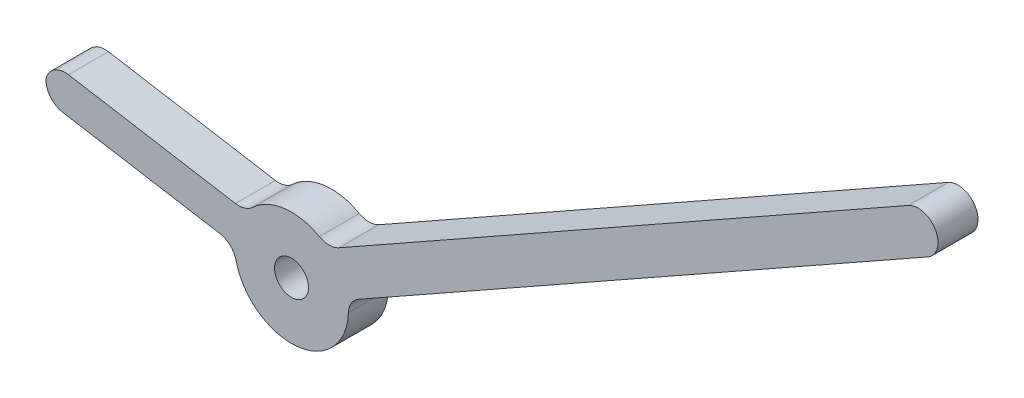
ISO-10303-21;
HEADER;
FILE_DESCRIPTION(('STEP AP214'),'2;1');
FILE_NAME('part.step','',(''),(''),'','','');
FILE_SCHEMA(('AUTOMOTIVE_DESIGN { 1 0 10303 214 1 1 1 1 }'));
ENDSEC;
DATA;
#1=APPLICATION_CONTEXT('core data for automotive mechanical design processes');
#2=APPLICATION_PROTOCOL_DEFINITION('international standard','automotive_design',2000,#1);
#3=PRODUCT_CONTEXT('',#1,'mechanical');
#4=PRODUCT('Part','Part','',(#3));
#5=PRODUCT_RELATED_PRODUCT_CATEGORY('part','',(#4));
#6=PRODUCT_DEFINITION_FORMATION('','',#4);
#7=PRODUCT_DEFINITION_CONTEXT('part definition',#1,'design');
#8=PRODUCT_DEFINITION('design','',#6,#7);
#9=PRODUCT_DEFINITION_SHAPE('','',#8);
#10=(LENGTH_UNIT() NAMED_UNIT(*) SI_UNIT(.MILLI.,.METRE.));
#11=(NAMED_UNIT(*) PLANE_ANGLE_UNIT() SI_UNIT($,.RADIAN.));
#12=(NAMED_UNIT(*) SI_UNIT($,.STERADIAN.) SOLID_ANGLE_UNIT());
#13=UNCERTAINTY_MEASURE_WITH_UNIT(LENGTH_MEASURE(1.E-05),#10,'distance_accuracy_value','');
#14=(GEOMETRIC_REPRESENTATION_CONTEXT(3) GLOBAL_UNCERTAINTY_ASSIGNED_CONTEXT((#13)) GLOBAL_UNIT_ASSIGNED_CONTEXT((#10,
#11,#12)) REPRESENTATION_CONTEXT('',''));
#15=CARTESIAN_POINT('',(0.,0.,0.));
#16=DIRECTION('',(0.,0.,1.));
#17=DIRECTION('',(1.,0.,0.));
#18=AXIS2_PLACEMENT_3D('',#15,#16,#17);
#19=CARTESIAN_POINT('',(0.,0.,5.08));
#20=DIRECTION('',(0.,0.,1.));
#21=DIRECTION('',(1.,0.,0.));
#22=AXIS2_PLACEMENT_3D('',#19,#20,#21);
#23=PLANE('',#22);
#24=CARTESIAN_POINT('',(0.,0.,5.08));
#25=DIRECTION('',(0.,0.,1.));
#26=DIRECTION('',(1.,0.,0.));
#27=AXIS2_PLACEMENT_3D('',#24,#25,#26);
#28=CIRCLE('',#27,2.159);
#29=CARTESIAN_POINT('',(2.159,0.,5.08));
#30=VERTEX_POINT('',#29);
#31=EDGE_CURVE('E214',#30,#30,#28,.T.);
#32=ORIENTED_EDGE('',*,*,#31,.F.);
#33=EDGE_LOOP('',(#32));
#34=FACE_BOUND('',#33,.T.);
#35=CARTESIAN_POINT('',(-28.7825653172988,5.67657491410361,5.08));
#36=DIRECTION('',(0.,0.,1.));
#37=DIRECTION('',(1.,0.,0.));
#38=AXIS2_PLACEMENT_3D('',#35,#36,#37);
#39=CIRCLE('',#38,2.54);
#40=CARTESIAN_POINT('',(-28.361591001819,8.18144629317806,5.08));
#41=VERTEX_POINT('',#40);
#42=CARTESIAN_POINT('',(-31.2056449020925,6.43833952719351,5.08));
#43=VERTEX_POINT('',#42);
#44=EDGE_CURVE('E217',#41,#43,#39,.T.);
#45=ORIENTED_EDGE('',*,*,#44,.T.);
#46=CARTESIAN_POINT('',(-28.6789330522204,6.17886461951211,5.08));
#47=DIRECTION('',(0.,0.,1.));
#48=DIRECTION('',(1.,0.,0.));
#49=AXIS2_PLACEMENT_3D('',#46,#47,#48);
#50=CIRCLE('',#49,2.54);
#51=CARTESIAN_POINT('',(-29.0999073677003,3.67399324043767,5.08));
#52=VERTEX_POINT('',#51);
#53=EDGE_CURVE('E236',#43,#52,#50,.T.);
#54=ORIENTED_EDGE('',*,*,#53,.T.);
#55=DIRECTION('',(-0.986169834281277,0.165737919480243,0.));
#56=VECTOR('',#55,1.);
#57=CARTESIAN_POINT('',(-0.198848510526395,-1.1831836871602,5.08));
#58=LINE('',#57,#56);
#59=CARTESIAN_POINT('',(-9.10953067593622,0.314365590770257,5.08));
#60=VERTEX_POINT('',#59);
#61=EDGE_CURVE('E223',#60,#52,#58,.T.);
#62=ORIENTED_EDGE('',*,*,#61,.F.);
#63=CARTESIAN_POINT('',(-9.53050499141603,-2.19050578830419,5.08));
#64=DIRECTION('',(0.,0.,1.));
#65=DIRECTION('',(1.,0.,0.));
#66=AXIS2_PLACEMENT_3D('',#63,#64,#65);
#67=CIRCLE('',#66,2.54);
#68=CARTESIAN_POINT('',(-7.05504914948979,-1.62154324588751,5.08));
#69=VERTEX_POINT('',#68);
#70=EDGE_CURVE('E268',#60,#69,#67,.F.);
#71=ORIENTED_EDGE('',*,*,#70,.T.);
#72=CARTESIAN_POINT('',(0.,0.,5.08));
#73=DIRECTION('',(0.,0.,1.));
#74=DIRECTION('',(1.,0.,0.));
#75=AXIS2_PLACEMENT_3D('',#72,#73,#74);
#76=CIRCLE('',#75,7.239);
#77=CARTESIAN_POINT('',(7.23520316387898,-0.234427339266629,5.08));
#78=VERTEX_POINT('',#77);
#79=EDGE_CURVE('E228',#69,#78,#76,.T.);
#80=ORIENTED_EDGE('',*,*,#79,.T.);
#81=CARTESIAN_POINT('',(9.77387094067862,-0.31668254602685,5.08));
#82=DIRECTION('',(0.,0.,1.));
#83=DIRECTION('',(1.,0.,0.));
#84=AXIS2_PLACEMENT_3D('',#81,#82,#83);
#85=CIRCLE('',#84,2.54);
#86=CARTESIAN_POINT('',(8.52536810292188,1.89529409582843,5.08));
#87=VERTEX_POINT('',#86);
#88=EDGE_CURVE('E265',#78,#87,#85,.F.);
#89=ORIENTED_EDGE('',*,*,#88,.T.);
#90=DIRECTION('',(0.870856945612317,0.491536550297927,0.));
#91=VECTOR('',#90,1.);
#92=CARTESIAN_POINT('',(1.24850283775674,-2.21197664185528,5.08));
#93=LINE('',#92,#91);
#94=CARTESIAN_POINT('',(80.9205819049126,42.7572219125618,5.08));
#95=VERTEX_POINT('',#94);
#96=EDGE_CURVE('E211',#87,#95,#93,.T.);
#97=ORIENTED_EDGE('',*,*,#96,.T.);
#98=CARTESIAN_POINT('',(79.6720790671559,44.9691985544171,5.08));
#99=DIRECTION('',(0.,0.,1.));
#100=DIRECTION('',(1.,0.,0.));
#101=AXIS2_PLACEMENT_3D('',#98,#99,#100);
#102=CIRCLE('',#101,2.54);
#103=CARTESIAN_POINT('',(78.4235762293991,47.1811751962724,5.08));
#104=VERTEX_POINT('',#103);
#105=EDGE_CURVE('E199',#95,#104,#102,.T.);
#106=ORIENTED_EDGE('',*,*,#105,.T.);
#107=DIRECTION('',(0.870856945612317,0.491536550297927,0.));
#108=VECTOR('',#107,1.);
#109=CARTESIAN_POINT('',(-1.24850283775674,2.21197664185528,5.08));
#110=LINE('',#109,#108);
#111=CARTESIAN_POINT('',(6.02836242740841,6.319247379539,5.08));
#112=VERTEX_POINT('',#111);
#113=EDGE_CURVE('E192',#112,#104,#110,.T.);
#114=ORIENTED_EDGE('',*,*,#113,.F.);
#115=CARTESIAN_POINT('',(4.77985958965168,8.53122402139429,5.08));
#116=DIRECTION('',(0.,0.,1.));
#117=DIRECTION('',(1.,0.,0.));
#118=AXIS2_PLACEMENT_3D('',#115,#116,#117);
#119=CIRCLE('',#118,2.54);
#120=CARTESIAN_POINT('',(3.53833761831358,6.31532167817499,5.08));
#121=VERTEX_POINT('',#120);
#122=EDGE_CURVE('E96',#112,#121,#119,.F.);
#123=ORIENTED_EDGE('',*,*,#122,.T.);
#124=CARTESIAN_POINT('',(0.,0.,5.08));
#125=DIRECTION('',(0.,0.,1.));
#126=DIRECTION('',(1.,0.,0.));
#127=AXIS2_PLACEMENT_3D('',#124,#125,#126);
#128=CIRCLE('',#127,7.239);
#129=CARTESIAN_POINT('',(-4.96410951537032,5.26884595707731,5.08));
#130=VERTEX_POINT('',#129);
#131=EDGE_CURVE('E222',#121,#130,#128,.T.);
#132=ORIENTED_EDGE('',*,*,#131,.T.);
#133=CARTESIAN_POINT('',(-6.70590232778095,7.11756383675356,5.08));
#134=DIRECTION('',(0.,0.,1.));
#135=DIRECTION('',(1.,0.,0.));
#136=AXIS2_PLACEMENT_3D('',#133,#134,#135);
#137=CIRCLE('',#136,2.54);
#138=CARTESIAN_POINT('',(-7.12687664326077,4.61269245767911,5.08));
#139=VERTEX_POINT('',#138);
#140=EDGE_CURVE('E272',#130,#139,#137,.F.);
#141=ORIENTED_EDGE('',*,*,#140,.T.);
#142=DIRECTION('',(-0.986169834281277,0.165737919480242,0.));
#143=VECTOR('',#142,1.);
#144=CARTESIAN_POINT('',(-5.76116023717156,4.38316708803502,5.08));
#145=LINE('',#144,#143);
#146=EDGE_CURVE('E226',#139,#41,#145,.T.);
#147=ORIENTED_EDGE('',*,*,#146,.T.);
#148=EDGE_LOOP('',(#45,#54,#62,#71,#80,#89,#97,#106,#114,#123,#132,#141,#147));
#149=FACE_BOUND('',#148,.T.);
#150=ADVANCED_FACE('F87',(#34,#149),#23,.T.);
#151=CARTESIAN_POINT('',(0.,0.,0.));
#152=DIRECTION('',(0.,0.,1.));
#153=DIRECTION('',(1.,0.,0.));
#154=AXIS2_PLACEMENT_3D('',#151,#152,#153);
#155=PLANE('',#154);
#156=CARTESIAN_POINT('',(0.,0.,0.));
#157=DIRECTION('',(0.,0.,1.));
#158=DIRECTION('',(1.,0.,0.));
#159=AXIS2_PLACEMENT_3D('',#156,#157,#158);
#160=CIRCLE('',#159,2.159);
#161=CARTESIAN_POINT('',(2.159,0.,0.));
#162=VERTEX_POINT('',#161);
#163=EDGE_CURVE('E212',#162,#162,#160,.T.);
#164=ORIENTED_EDGE('',*,*,#163,.T.);
#165=EDGE_LOOP('',(#164));
#166=FACE_BOUND('',#165,.T.);
#167=DIRECTION('',(-0.986169834281277,0.165737919480243,0.));
#168=VECTOR('',#167,1.);
#169=CARTESIAN_POINT('',(-0.198848510526395,-1.1831836871602,0.));
#170=LINE('',#169,#168);
#171=CARTESIAN_POINT('',(-9.10953067593622,0.314365590770257,0.));
#172=VERTEX_POINT('',#171);
#173=CARTESIAN_POINT('',(-29.0999073677003,3.67399324043767,0.));
#174=VERTEX_POINT('',#173);
#175=EDGE_CURVE('E227',#172,#174,#170,.T.);
#176=ORIENTED_EDGE('',*,*,#175,.T.);
#177=CARTESIAN_POINT('',(-28.6789330522204,6.17886461951211,0.));
#178=DIRECTION('',(0.,0.,1.));
#179=DIRECTION('',(1.,0.,0.));
#180=AXIS2_PLACEMENT_3D('',#177,#178,#179);
#181=CIRCLE('',#180,2.54);
#182=CARTESIAN_POINT('',(-31.2056449020925,6.43833952719351,0.));
#183=VERTEX_POINT('',#182);
#184=EDGE_CURVE('E103',#174,#183,#181,.F.);
#185=ORIENTED_EDGE('',*,*,#184,.T.);
#186=CARTESIAN_POINT('',(-28.7825653172988,5.67657491410361,0.));
#187=DIRECTION('',(0.,0.,1.));
#188=DIRECTION('',(1.,0.,0.));
#189=AXIS2_PLACEMENT_3D('',#186,#187,#188);
#190=CIRCLE('',#189,2.54);
#191=CARTESIAN_POINT('',(-28.361591001819,8.18144629317806,0.));
#192=VERTEX_POINT('',#191);
#193=EDGE_CURVE('E244',#183,#192,#190,.F.);
#194=ORIENTED_EDGE('',*,*,#193,.T.);
#195=DIRECTION('',(-0.986169834281277,0.165737919480243,0.));
#196=VECTOR('',#195,1.);
#197=CARTESIAN_POINT('',(0.558156328856895,3.32112853870757,0.));
#198=LINE('',#197,#196);
#199=CARTESIAN_POINT('',(-7.12687664326077,4.61269245767911,0.));
#200=VERTEX_POINT('',#199);
#201=EDGE_CURVE('E308',#200,#192,#198,.T.);
#202=ORIENTED_EDGE('',*,*,#201,.F.);
#203=CARTESIAN_POINT('',(-6.70590232778095,7.11756383675356,0.));
#204=DIRECTION('',(0.,0.,1.));
#205=DIRECTION('',(1.,0.,0.));
#206=AXIS2_PLACEMENT_3D('',#203,#204,#205);
#207=CIRCLE('',#206,2.54);
#208=CARTESIAN_POINT('',(-4.96410951537032,5.26884595707731,0.));
#209=VERTEX_POINT('',#208);
#210=EDGE_CURVE('E274',#200,#209,#207,.T.);
#211=ORIENTED_EDGE('',*,*,#210,.T.);
#212=CARTESIAN_POINT('',(0.,0.,0.));
#213=DIRECTION('',(0.,0.,1.));
#214=DIRECTION('',(1.,0.,0.));
#215=AXIS2_PLACEMENT_3D('',#212,#213,#214);
#216=CIRCLE('',#215,7.239);
#217=CARTESIAN_POINT('',(3.53833761831358,6.31532167817499,0.));
#218=VERTEX_POINT('',#217);
#219=EDGE_CURVE('E288',#218,#209,#216,.T.);
#220=ORIENTED_EDGE('',*,*,#219,.F.);
#221=CARTESIAN_POINT('',(4.77985958965168,8.53122402139429,0.));
#222=DIRECTION('',(0.,0.,1.));
#223=DIRECTION('',(1.,0.,0.));
#224=AXIS2_PLACEMENT_3D('',#221,#222,#223);
#225=CIRCLE('',#224,2.54);
#226=CARTESIAN_POINT('',(6.02836242740841,6.319247379539,0.));
#227=VERTEX_POINT('',#226);
#228=EDGE_CURVE('E12',#218,#227,#225,.T.);
#229=ORIENTED_EDGE('',*,*,#228,.T.);
#230=DIRECTION('',(0.870856945612317,0.491536550297927,0.));
#231=VECTOR('',#230,1.);
#232=CARTESIAN_POINT('',(-1.24850283775674,2.21197664185528,0.));
#233=LINE('',#232,#231);
#234=CARTESIAN_POINT('',(78.4235762293991,47.1811751962724,0.));
#235=VERTEX_POINT('',#234);
#236=EDGE_CURVE('E201',#227,#235,#233,.T.);
#237=ORIENTED_EDGE('',*,*,#236,.T.);
#238=CARTESIAN_POINT('',(79.6720790671559,44.9691985544171,0.));
#239=DIRECTION('',(0.,0.,1.));
#240=DIRECTION('',(1.,0.,0.));
#241=AXIS2_PLACEMENT_3D('',#238,#239,#240);
#242=CIRCLE('',#241,2.54);
#243=CARTESIAN_POINT('',(80.9205819049126,42.7572219125618,0.));
#244=VERTEX_POINT('',#243);
#245=EDGE_CURVE('E191',#244,#235,#242,.T.);
#246=ORIENTED_EDGE('',*,*,#245,.F.);
#247=DIRECTION('',(0.870856945612317,0.491536550297927,0.));
#248=VECTOR('',#247,1.);
#249=CARTESIAN_POINT('',(1.24850283775674,-2.21197664185528,0.));
#250=LINE('',#249,#248);
#251=CARTESIAN_POINT('',(8.52536810292188,1.89529409582843,0.));
#252=VERTEX_POINT('',#251);
#253=EDGE_CURVE('E182',#252,#244,#250,.T.);
#254=ORIENTED_EDGE('',*,*,#253,.F.);
#255=CARTESIAN_POINT('',(9.77387094067862,-0.31668254602685,0.));
#256=DIRECTION('',(0.,0.,1.));
#257=DIRECTION('',(1.,0.,0.));
#258=AXIS2_PLACEMENT_3D('',#255,#256,#257);
#259=CIRCLE('',#258,2.54);
#260=CARTESIAN_POINT('',(7.23520316387898,-0.234427339266629,0.));
#261=VERTEX_POINT('',#260);
#262=EDGE_CURVE('E110',#252,#261,#259,.T.);
#263=ORIENTED_EDGE('',*,*,#262,.T.);
#264=CARTESIAN_POINT('',(0.,0.,0.));
#265=DIRECTION('',(0.,0.,1.));
#266=DIRECTION('',(1.,0.,0.));
#267=AXIS2_PLACEMENT_3D('',#264,#265,#266);
#268=CIRCLE('',#267,7.239);
#269=CARTESIAN_POINT('',(-7.05504914948979,-1.62154324588751,0.));
#270=VERTEX_POINT('',#269);
#271=EDGE_CURVE('E298',#270,#261,#268,.T.);
#272=ORIENTED_EDGE('',*,*,#271,.F.);
#273=CARTESIAN_POINT('',(-9.53050499141603,-2.19050578830419,0.));
#274=DIRECTION('',(0.,0.,1.));
#275=DIRECTION('',(1.,0.,0.));
#276=AXIS2_PLACEMENT_3D('',#273,#274,#275);
#277=CIRCLE('',#276,2.54);
#278=EDGE_CURVE('E270',#270,#172,#277,.T.);
#279=ORIENTED_EDGE('',*,*,#278,.T.);
#280=EDGE_LOOP('',(#176,#185,#194,#202,#211,#220,#229,#237,#246,#254,#263,#272,#279));
#281=FACE_BOUND('',#280,.T.);
#282=ADVANCED_FACE('F203',(#166,#281),#155,.F.);
#283=CARTESIAN_POINT('',(0.,0.,5.08));
#284=DIRECTION('',(0.,0.,-1.));
#285=DIRECTION('',(-1.,0.,0.));
#286=AXIS2_PLACEMENT_3D('',#283,#284,#285);
#287=CYLINDRICAL_SURFACE('',#286,2.159);
#288=ORIENTED_EDGE('',*,*,#31,.T.);
#289=EDGE_LOOP('',(#288));
#290=FACE_BOUND('',#289,.T.);
#291=ORIENTED_EDGE('',*,*,#163,.F.);
#292=EDGE_LOOP('',(#291));
#293=FACE_BOUND('',#292,.T.);
#294=ADVANCED_FACE('F342',(#290,#293),#287,.F.);
#295=CARTESIAN_POINT('',(1.24850283775674,-2.21197664185528,0.));
#296=DIRECTION('',(0.491536550297927,-0.870856945612317,0.));
#297=DIRECTION('',(0.870856945612317,0.491536550297927,0.));
#298=AXIS2_PLACEMENT_3D('',#295,#296,#297);
#299=PLANE('',#298);
#300=ORIENTED_EDGE('',*,*,#96,.F.);
#301=DIRECTION('',(0.,0.,-1.));
#302=VECTOR('',#301,1.);
#303=CARTESIAN_POINT('',(8.52536810292188,1.89529409582843,0.));
#304=LINE('',#303,#302);
#305=EDGE_CURVE('E189',#87,#252,#304,.T.);
#306=ORIENTED_EDGE('',*,*,#305,.T.);
#307=ORIENTED_EDGE('',*,*,#253,.T.);
#308=DIRECTION('',(0.,0.,1.));
#309=VECTOR('',#308,1.);
#310=CARTESIAN_POINT('',(80.9205819049126,42.7572219125618,0.));
#311=LINE('',#310,#309);
#312=EDGE_CURVE('E186',#244,#95,#311,.T.);
#313=ORIENTED_EDGE('',*,*,#312,.T.);
#314=EDGE_LOOP('',(#300,#306,#307,#313));
#315=FACE_BOUND('',#314,.T.);
#316=ADVANCED_FACE('F185',(#315),#299,.T.);
#317=CARTESIAN_POINT('',(-1.24850283775674,2.21197664185528,0.));
#318=DIRECTION('',(0.491536550297927,-0.870856945612317,0.));
#319=DIRECTION('',(0.870856945612317,0.491536550297927,0.));
#320=AXIS2_PLACEMENT_3D('',#317,#318,#319);
#321=PLANE('',#320);
#322=ORIENTED_EDGE('',*,*,#236,.F.);
#323=DIRECTION('',(0.,0.,1.));
#324=VECTOR('',#323,1.);
#325=CARTESIAN_POINT('',(6.02836242740841,6.319247379539,0.));
#326=LINE('',#325,#324);
#327=EDGE_CURVE('E262',#227,#112,#326,.T.);
#328=ORIENTED_EDGE('',*,*,#327,.T.);
#329=ORIENTED_EDGE('',*,*,#113,.T.);
#330=DIRECTION('',(0.,0.,1.));
#331=VECTOR('',#330,1.);
#332=CARTESIAN_POINT('',(78.4235762293991,47.1811751962724,0.));
#333=LINE('',#332,#331);
#334=EDGE_CURVE('E200',#235,#104,#333,.T.);
#335=ORIENTED_EDGE('',*,*,#334,.F.);
#336=EDGE_LOOP('',(#322,#328,#329,#335));
#337=FACE_BOUND('',#336,.T.);
#338=ADVANCED_FACE('F290',(#337),#321,.F.);
#339=CARTESIAN_POINT('',(79.6720790671559,44.9691985544171,0.));
#340=DIRECTION('',(0.,0.,1.));
#341=DIRECTION('',(1.,0.,0.));
#342=AXIS2_PLACEMENT_3D('',#339,#340,#341);
#343=CYLINDRICAL_SURFACE('',#342,2.54);
#344=ORIENTED_EDGE('',*,*,#105,.F.);
#345=ORIENTED_EDGE('',*,*,#312,.F.);
#346=ORIENTED_EDGE('',*,*,#245,.T.);
#347=ORIENTED_EDGE('',*,*,#334,.T.);
#348=EDGE_LOOP('',(#344,#345,#346,#347));
#349=FACE_BOUND('',#348,.T.);
#350=ADVANCED_FACE('F196',(#349),#343,.T.);
#351=CARTESIAN_POINT('',(0.,0.,0.));
#352=DIRECTION('',(0.,0.,1.));
#353=DIRECTION('',(1.,0.,0.));
#354=AXIS2_PLACEMENT_3D('',#351,#352,#353);
#355=CYLINDRICAL_SURFACE('',#354,7.239);
#356=ORIENTED_EDGE('',*,*,#219,.T.);
#357=DIRECTION('',(0.,0.,1.));
#358=VECTOR('',#357,1.);
#359=CARTESIAN_POINT('',(-4.96410951537032,5.26884595707731,0.));
#360=LINE('',#359,#358);
#361=EDGE_CURVE('E259',#209,#130,#360,.T.);
#362=ORIENTED_EDGE('',*,*,#361,.T.);
#363=ORIENTED_EDGE('',*,*,#131,.F.);
#364=DIRECTION('',(0.,0.,1.));
#365=VECTOR('',#364,1.);
#366=CARTESIAN_POINT('',(3.53833761831358,6.31532167817499,0.));
#367=LINE('',#366,#365);
#368=EDGE_CURVE('E257',#121,#218,#367,.F.);
#369=ORIENTED_EDGE('',*,*,#368,.T.);
#370=EDGE_LOOP('',(#356,#362,#363,#369));
#371=FACE_BOUND('',#370,.T.);
#372=ADVANCED_FACE('F284',(#371),#355,.T.);
#373=CARTESIAN_POINT('',(0.558156328856895,3.32112853870757,0.));
#374=DIRECTION('',(0.165737919480243,0.986169834281277,0.));
#375=DIRECTION('',(-0.986169834281277,0.165737919480243,0.));
#376=AXIS2_PLACEMENT_3D('',#373,#374,#375);
#377=PLANE('',#376);
#378=ORIENTED_EDGE('',*,*,#201,.T.);
#379=DIRECTION('',(0.,0.,1.));
#380=VECTOR('',#379,1.);
#381=CARTESIAN_POINT('',(-28.361591001819,8.18144629317806,5.08));
#382=LINE('',#381,#380);
#383=EDGE_CURVE('E249',#192,#41,#382,.T.);
#384=ORIENTED_EDGE('',*,*,#383,.T.);
#385=ORIENTED_EDGE('',*,*,#146,.F.);
#386=DIRECTION('',(0.,0.,-1.));
#387=VECTOR('',#386,1.);
#388=CARTESIAN_POINT('',(-7.12687664326077,4.61269245767911,0.));
#389=LINE('',#388,#387);
#390=EDGE_CURVE('E247',#139,#200,#389,.T.);
#391=ORIENTED_EDGE('',*,*,#390,.T.);
#392=EDGE_LOOP('',(#378,#384,#385,#391));
#393=FACE_BOUND('',#392,.T.);
#394=ADVANCED_FACE('F325',(#393),#377,.T.);
#395=CARTESIAN_POINT('',(0.,0.,0.));
#396=DIRECTION('',(0.,0.,1.));
#397=DIRECTION('',(1.,0.,0.));
#398=AXIS2_PLACEMENT_3D('',#395,#396,#397);
#399=CYLINDRICAL_SURFACE('',#398,7.239);
#400=ORIENTED_EDGE('',*,*,#271,.T.);
#401=DIRECTION('',(0.,0.,1.));
#402=VECTOR('',#401,1.);
#403=CARTESIAN_POINT('',(7.23520316387898,-0.234427339266629,0.));
#404=LINE('',#403,#402);
#405=EDGE_CURVE('E253',#261,#78,#404,.T.);
#406=ORIENTED_EDGE('',*,*,#405,.T.);
#407=ORIENTED_EDGE('',*,*,#79,.F.);
#408=DIRECTION('',(0.,0.,1.));
#409=VECTOR('',#408,1.);
#410=CARTESIAN_POINT('',(-7.05504914948979,-1.62154324588751,0.));
#411=LINE('',#410,#409);
#412=EDGE_CURVE('E251',#69,#270,#411,.F.);
#413=ORIENTED_EDGE('',*,*,#412,.T.);
#414=EDGE_LOOP('',(#400,#406,#407,#413));
#415=FACE_BOUND('',#414,.T.);
#416=ADVANCED_FACE('F296',(#415),#399,.T.);
#417=CARTESIAN_POINT('',(-0.198848510526395,-1.1831836871602,0.));
#418=DIRECTION('',(0.165737919480243,0.986169834281277,0.));
#419=DIRECTION('',(-0.986169834281277,0.165737919480243,0.));
#420=AXIS2_PLACEMENT_3D('',#417,#418,#419);
#421=PLANE('',#420);
#422=ORIENTED_EDGE('',*,*,#61,.T.);
#423=DIRECTION('',(0.,0.,-1.));
#424=VECTOR('',#423,1.);
#425=CARTESIAN_POINT('',(-29.0999073677003,3.67399324043767,0.));
#426=LINE('',#425,#424);
#427=EDGE_CURVE('E241',#52,#174,#426,.T.);
#428=ORIENTED_EDGE('',*,*,#427,.T.);
#429=ORIENTED_EDGE('',*,*,#175,.F.);
#430=DIRECTION('',(0.,0.,1.));
#431=VECTOR('',#430,1.);
#432=CARTESIAN_POINT('',(-9.10953067593622,0.314365590770257,0.));
#433=LINE('',#432,#431);
#434=EDGE_CURVE('E238',#172,#60,#433,.T.);
#435=ORIENTED_EDGE('',*,*,#434,.T.);
#436=EDGE_LOOP('',(#422,#428,#429,#435));
#437=FACE_BOUND('',#436,.T.);
#438=ADVANCED_FACE('F306',(#437),#421,.F.);
#439=CARTESIAN_POINT('',(-28.7825653172988,5.67657491410361,5.08));
#440=DIRECTION('',(0.,0.,-1.));
#441=DIRECTION('',(-1.,0.,0.));
#442=AXIS2_PLACEMENT_3D('',#439,#440,#441);
#443=CYLINDRICAL_SURFACE('',#442,2.54);
#444=ORIENTED_EDGE('',*,*,#383,.F.);
#445=ORIENTED_EDGE('',*,*,#193,.F.);
#446=DIRECTION('',(0.,0.,-1.));
#447=VECTOR('',#446,1.);
#448=CARTESIAN_POINT('',(-31.2056449020925,6.43833952719351,2.54));
#449=LINE('',#448,#447);
#450=EDGE_CURVE('E91',#43,#183,#449,.T.);
#451=ORIENTED_EDGE('',*,*,#450,.F.);
#452=ORIENTED_EDGE('',*,*,#44,.F.);
#453=EDGE_LOOP('',(#444,#445,#451,#452));
#454=FACE_BOUND('',#453,.T.);
#455=ADVANCED_FACE('F321',(#454),#443,.T.);
#456=CARTESIAN_POINT('',(-28.6789330522204,6.17886461951211,5.08));
#457=DIRECTION('',(0.,0.,-1.));
#458=DIRECTION('',(-1.,0.,0.));
#459=AXIS2_PLACEMENT_3D('',#456,#457,#458);
#460=CYLINDRICAL_SURFACE('',#459,2.54);
#461=ORIENTED_EDGE('',*,*,#184,.F.);
#462=ORIENTED_EDGE('',*,*,#427,.F.);
#463=ORIENTED_EDGE('',*,*,#53,.F.);
#464=ORIENTED_EDGE('',*,*,#450,.T.);
#465=EDGE_LOOP('',(#461,#462,#463,#464));
#466=FACE_BOUND('',#465,.T.);
#467=ADVANCED_FACE('F317',(#466),#460,.T.);
#468=CARTESIAN_POINT('',(9.77387094067862,-0.31668254602685,0.));
#469=DIRECTION('',(0.,0.,1.));
#470=DIRECTION('',(1.,0.,0.));
#471=AXIS2_PLACEMENT_3D('',#468,#469,#470);
#472=CYLINDRICAL_SURFACE('',#471,2.54);
#473=ORIENTED_EDGE('',*,*,#262,.F.);
#474=ORIENTED_EDGE('',*,*,#305,.F.);
#475=ORIENTED_EDGE('',*,*,#88,.F.);
#476=ORIENTED_EDGE('',*,*,#405,.F.);
#477=EDGE_LOOP('',(#473,#474,#475,#476));
#478=FACE_BOUND('',#477,.T.);
#479=ADVANCED_FACE('F292',(#478),#472,.F.);
#480=CARTESIAN_POINT('',(-9.53050499141603,-2.19050578830419,0.));
#481=DIRECTION('',(0.,0.,1.));
#482=DIRECTION('',(1.,0.,0.));
#483=AXIS2_PLACEMENT_3D('',#480,#481,#482);
#484=CYLINDRICAL_SURFACE('',#483,2.54);
#485=ORIENTED_EDGE('',*,*,#278,.F.);
#486=ORIENTED_EDGE('',*,*,#412,.F.);
#487=ORIENTED_EDGE('',*,*,#70,.F.);
#488=ORIENTED_EDGE('',*,*,#434,.F.);
#489=EDGE_LOOP('',(#485,#486,#487,#488));
#490=FACE_BOUND('',#489,.T.);
#491=ADVANCED_FACE('F303',(#490),#484,.F.);
#492=CARTESIAN_POINT('',(-6.70590232778095,7.11756383675356,0.));
#493=DIRECTION('',(0.,0.,1.));
#494=DIRECTION('',(1.,0.,0.));
#495=AXIS2_PLACEMENT_3D('',#492,#493,#494);
#496=CYLINDRICAL_SURFACE('',#495,2.54);
#497=ORIENTED_EDGE('',*,*,#210,.F.);
#498=ORIENTED_EDGE('',*,*,#390,.F.);
#499=ORIENTED_EDGE('',*,*,#140,.F.);
#500=ORIENTED_EDGE('',*,*,#361,.F.);
#501=EDGE_LOOP('',(#497,#498,#499,#500));
#502=FACE_BOUND('',#501,.T.);
#503=ADVANCED_FACE('F329',(#502),#496,.F.);
#504=CARTESIAN_POINT('',(4.77985958965168,8.53122402139429,0.));
#505=DIRECTION('',(0.,0.,1.));
#506=DIRECTION('',(1.,0.,0.));
#507=AXIS2_PLACEMENT_3D('',#504,#505,#506);
#508=CYLINDRICAL_SURFACE('',#507,2.54);
#509=ORIENTED_EDGE('',*,*,#228,.F.);
#510=ORIENTED_EDGE('',*,*,#368,.F.);
#511=ORIENTED_EDGE('',*,*,#122,.F.);
#512=ORIENTED_EDGE('',*,*,#327,.F.);
#513=EDGE_LOOP('',(#509,#510,#511,#512));
#514=FACE_BOUND('',#513,.T.);
#515=ADVANCED_FACE('F89',(#514),#508,.F.);
#516=CLOSED_SHELL('',(#150,#282,#294,#316,#338,#350,#372,#394,#416,#438,#455,#467,#479,#491,
#503,#515));
#517=MANIFOLD_SOLID_BREP('B2',#516);
#518=ADVANCED_BREP_SHAPE_REPRESENTATION('',(#18,#517),#14);
#519=SHAPE_DEFINITION_REPRESENTATION(#9,#518);
ENDSEC;
END-ISO-10303-21;
